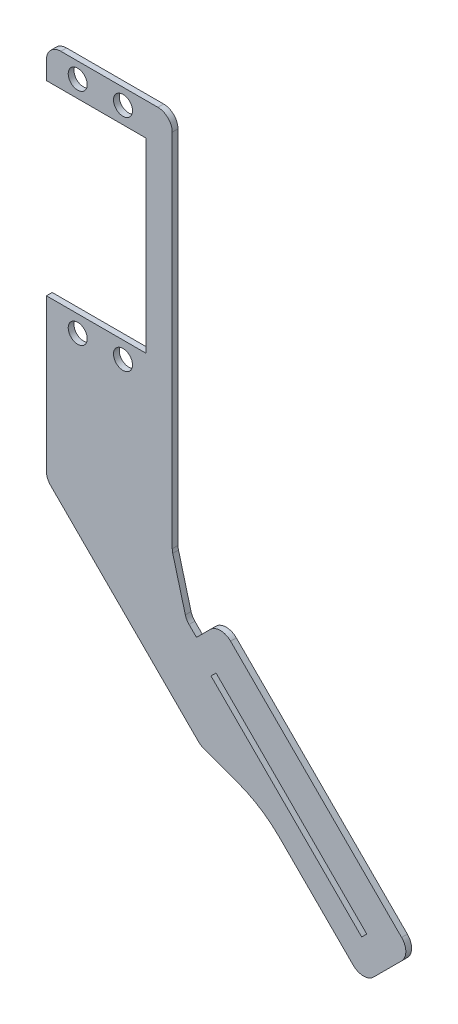
ISO-10303-21;
HEADER;
FILE_DESCRIPTION(('STEP AP214'),'2;1');
FILE_NAME('part.step','',(''),(''),'','','');
FILE_SCHEMA(('AUTOMOTIVE_DESIGN { 1 0 10303 214 1 1 1 1 }'));
ENDSEC;
DATA;
#1=APPLICATION_CONTEXT('core data for automotive mechanical design processes');
#2=APPLICATION_PROTOCOL_DEFINITION('international standard','automotive_design',2000,#1);
#3=PRODUCT_CONTEXT('',#1,'mechanical');
#4=PRODUCT('Part','Part','',(#3));
#5=PRODUCT_RELATED_PRODUCT_CATEGORY('part','',(#4));
#6=PRODUCT_DEFINITION_FORMATION('','',#4);
#7=PRODUCT_DEFINITION_CONTEXT('part definition',#1,'design');
#8=PRODUCT_DEFINITION('design','',#6,#7);
#9=PRODUCT_DEFINITION_SHAPE('','',#8);
#10=(LENGTH_UNIT() NAMED_UNIT(*) SI_UNIT(.MILLI.,.METRE.));
#11=(NAMED_UNIT(*) PLANE_ANGLE_UNIT() SI_UNIT($,.RADIAN.));
#12=(NAMED_UNIT(*) SI_UNIT($,.STERADIAN.) SOLID_ANGLE_UNIT());
#13=UNCERTAINTY_MEASURE_WITH_UNIT(LENGTH_MEASURE(1.E-05),#10,'distance_accuracy_value','');
#14=(GEOMETRIC_REPRESENTATION_CONTEXT(3) GLOBAL_UNCERTAINTY_ASSIGNED_CONTEXT((#13)) GLOBAL_UNIT_ASSIGNED_CONTEXT((#10,
#11,#12)) REPRESENTATION_CONTEXT('',''));
#15=CARTESIAN_POINT('',(0.,0.,0.));
#16=DIRECTION('',(0.,0.,1.));
#17=DIRECTION('',(1.,0.,0.));
#18=AXIS2_PLACEMENT_3D('',#15,#16,#17);
#19=CARTESIAN_POINT('',(-24.4386459429542,-113.02950543493,1.27));
#20=DIRECTION('',(0.707106781186551,0.707106781186544,0.));
#21=DIRECTION('',(-0.707106781186544,0.707106781186551,0.));
#22=AXIS2_PLACEMENT_3D('',#19,#20,#21);
#23=PLANE('',#22);
#24=DIRECTION('',(0.707106781186544,-0.707106781186551,0.));
#25=VECTOR('',#24,1.);
#26=CARTESIAN_POINT('',(-24.4386459429542,-113.02950543493,0.));
#27=LINE('',#26,#25);
#28=CARTESIAN_POINT('',(-43.0102590600247,-94.4578923178591,0.));
#29=VERTEX_POINT('',#28);
#30=CARTESIAN_POINT('',(-26.6837099732214,-110.784441404663,0.));
#31=VERTEX_POINT('',#30);
#32=EDGE_CURVE('E420',#29,#31,#27,.T.);
#33=ORIENTED_EDGE('',*,*,#32,.T.);
#34=DIRECTION('',(0.,0.,-1.));
#35=VECTOR('',#34,1.);
#36=CARTESIAN_POINT('',(-26.6837099732214,-110.784441404663,1.27));
#37=LINE('',#36,#35);
#38=CARTESIAN_POINT('',(-26.6837099732214,-110.784441404663,1.27));
#39=VERTEX_POINT('',#38);
#40=EDGE_CURVE('E595',#31,#39,#37,.F.);
#41=ORIENTED_EDGE('',*,*,#40,.T.);
#42=DIRECTION('',(0.707106781186544,-0.707106781186551,0.));
#43=VECTOR('',#42,1.);
#44=CARTESIAN_POINT('',(-24.4386459429542,-113.02950543493,1.27));
#45=LINE('',#44,#43);
#46=CARTESIAN_POINT('',(-43.0102590600247,-94.4578923178591,1.27));
#47=VERTEX_POINT('',#46);
#48=EDGE_CURVE('E392',#47,#39,#45,.T.);
#49=ORIENTED_EDGE('',*,*,#48,.F.);
#50=DIRECTION('',(0.,0.,1.));
#51=VECTOR('',#50,1.);
#52=CARTESIAN_POINT('',(-43.0102590600247,-94.4578923178591,0.));
#53=LINE('',#52,#51);
#54=EDGE_CURVE('E499',#47,#29,#53,.F.);
#55=ORIENTED_EDGE('',*,*,#54,.T.);
#56=EDGE_LOOP('',(#33,#41,#49,#55));
#57=FACE_BOUND('',#56,.T.);
#58=ADVANCED_FACE('F100',(#57),#23,.F.);
#59=CARTESIAN_POINT('',(0.,0.,0.));
#60=DIRECTION('',(0.,0.,1.));
#61=DIRECTION('',(1.,0.,0.));
#62=AXIS2_PLACEMENT_3D('',#59,#60,#61);
#63=PLANE('',#62);
#64=DIRECTION('',(0.,-1.,0.));
#65=VECTOR('',#64,1.);
#66=CARTESIAN_POINT('',(-94.45625,31.75,0.));
#67=LINE('',#66,#65);
#68=CARTESIAN_POINT('',(-94.45625,28.575,0.));
#69=VERTEX_POINT('',#68);
#70=CARTESIAN_POINT('',(-94.45625,24.549999922,0.));
#71=VERTEX_POINT('',#70);
#72=EDGE_CURVE('E411',#69,#71,#67,.T.);
#73=ORIENTED_EDGE('',*,*,#72,.F.);
#74=CARTESIAN_POINT('',(-91.28125,28.575,0.));
#75=DIRECTION('',(0.,0.,1.));
#76=DIRECTION('',(1.,0.,0.));
#77=AXIS2_PLACEMENT_3D('',#74,#75,#76);
#78=CIRCLE('',#77,3.175);
#79=CARTESIAN_POINT('',(-91.28125,31.75,0.));
#80=VERTEX_POINT('',#79);
#81=EDGE_CURVE('E531',#69,#80,#78,.F.);
#82=ORIENTED_EDGE('',*,*,#81,.T.);
#83=DIRECTION('',(-1.,0.,0.));
#84=VECTOR('',#83,1.);
#85=CARTESIAN_POINT('',(-94.45625,31.75,0.));
#86=LINE('',#85,#84);
#87=CARTESIAN_POINT('',(-69.85,31.75,0.));
#88=VERTEX_POINT('',#87);
#89=EDGE_CURVE('E440',#88,#80,#86,.T.);
#90=ORIENTED_EDGE('',*,*,#89,.F.);
#91=CARTESIAN_POINT('',(-69.85,28.575,0.));
#92=DIRECTION('',(0.,0.,1.));
#93=DIRECTION('',(1.,0.,0.));
#94=AXIS2_PLACEMENT_3D('',#91,#92,#93);
#95=CIRCLE('',#94,3.175);
#96=CARTESIAN_POINT('',(-66.675,28.575,0.));
#97=VERTEX_POINT('',#96);
#98=EDGE_CURVE('E528',#88,#97,#95,.F.);
#99=ORIENTED_EDGE('',*,*,#98,.T.);
#100=DIRECTION('',(0.,1.,0.));
#101=VECTOR('',#100,1.);
#102=CARTESIAN_POINT('',(-66.675,31.75,0.));
#103=LINE('',#102,#101);
#104=CARTESIAN_POINT('',(-66.675,-51.0963760254011,0.));
#105=VERTEX_POINT('',#104);
#106=EDGE_CURVE('E436',#105,#97,#103,.T.);
#107=ORIENTED_EDGE('',*,*,#106,.F.);
#108=CARTESIAN_POINT('',(-63.5,-51.0963760254011,0.));
#109=DIRECTION('',(0.,0.,1.));
#110=DIRECTION('',(1.,0.,0.));
#111=AXIS2_PLACEMENT_3D('',#108,#109,#110);
#112=CIRCLE('',#111,3.175);
#113=CARTESIAN_POINT('',(-66.5668144984679,-51.9181264936013,0.));
#114=VERTEX_POINT('',#113);
#115=EDGE_CURVE('E611',#105,#114,#112,.T.);
#116=ORIENTED_EDGE('',*,*,#115,.T.);
#117=DIRECTION('',(-0.258819045102407,0.965925826289099,0.));
#118=VECTOR('',#117,1.);
#119=CARTESIAN_POINT('',(-66.675,-51.514372705241,0.));
#120=LINE('',#119,#118);
#121=CARTESIAN_POINT('',(-63.7830668735738,-62.30721406516,0.));
#122=VERTEX_POINT('',#121);
#123=EDGE_CURVE('E432',#122,#114,#120,.T.);
#124=ORIENTED_EDGE('',*,*,#123,.F.);
#125=CARTESIAN_POINT('',(-60.7162523751059,-61.4854635969599,0.));
#126=DIRECTION('',(0.,0.,1.));
#127=DIRECTION('',(1.,0.,0.));
#128=AXIS2_PLACEMENT_3D('',#125,#126,#127);
#129=CIRCLE('',#128,3.175);
#130=CARTESIAN_POINT('',(-62.9613164053732,-63.7305276272271,0.));
#131=VERTEX_POINT('',#130);
#132=EDGE_CURVE('E109',#122,#131,#129,.T.);
#133=ORIENTED_EDGE('',*,*,#132,.T.);
#134=DIRECTION('',(-0.707106781186544,0.707106781186551,0.));
#135=VECTOR('',#134,1.);
#136=CARTESIAN_POINT('',(-19.0504922703126,-107.641351762288,0.));
#137=LINE('',#136,#135);
#138=CARTESIAN_POINT('',(-61.3178154689724,-65.374028563628,0.));
#139=VERTEX_POINT('',#138);
#140=EDGE_CURVE('E424',#139,#131,#137,.T.);
#141=ORIENTED_EDGE('',*,*,#140,.F.);
#142=DIRECTION('',(0.707106781186544,0.707106781186551,0.));
#143=VECTOR('',#142,1.);
#144=CARTESIAN_POINT('',(-62.7731733770223,-66.8293864716779,0.));
#145=LINE('',#144,#143);
#146=CARTESIAN_POINT('',(-58.2830453164879,-62.3392584111435,0.));
#147=VERTEX_POINT('',#146);
#148=EDGE_CURVE('E481',#139,#147,#145,.T.);
#149=ORIENTED_EDGE('',*,*,#148,.T.);
#150=CARTESIAN_POINT('',(-56.0379812862206,-64.5843224414107,0.));
#151=DIRECTION('',(0.,0.,1.));
#152=DIRECTION('',(1.,0.,0.));
#153=AXIS2_PLACEMENT_3D('',#150,#151,#152);
#154=CIRCLE('',#153,3.175);
#155=CARTESIAN_POINT('',(-53.7929172559533,-62.3392584111434,0.));
#156=VERTEX_POINT('',#155);
#157=EDGE_CURVE('E525',#147,#156,#154,.F.);
#158=ORIENTED_EDGE('',*,*,#157,.T.);
#159=DIRECTION('',(0.707106781186551,-0.707106781186544,0.));
#160=VECTOR('',#159,1.);
#161=CARTESIAN_POINT('',(-58.0660878335488,-58.066087833548,0.));
#162=LINE('',#161,#160);
#163=CARTESIAN_POINT('',(-16.0157221178277,-100.116453549269,0.));
#164=VERTEX_POINT('',#163);
#165=EDGE_CURVE('E477',#156,#164,#162,.T.);
#166=ORIENTED_EDGE('',*,*,#165,.T.);
#167=CARTESIAN_POINT('',(-18.260786148095,-102.361517579536,0.));
#168=DIRECTION('',(0.,0.,1.));
#169=DIRECTION('',(1.,0.,0.));
#170=AXIS2_PLACEMENT_3D('',#167,#168,#169);
#171=CIRCLE('',#170,3.175);
#172=CARTESIAN_POINT('',(-16.0157221178277,-104.606581609803,0.));
#173=VERTEX_POINT('',#172);
#174=EDGE_CURVE('E522',#164,#173,#171,.F.);
#175=ORIENTED_EDGE('',*,*,#174,.T.);
#176=DIRECTION('',(-0.707106781186544,-0.707106781186551,0.));
#177=VECTOR('',#176,1.);
#178=CARTESIAN_POINT('',(-20.505850178362,-109.096709670338,0.));
#179=LINE('',#178,#177);
#180=CARTESIAN_POINT('',(-22.1935819126868,-110.784441404663,0.));
#181=VERTEX_POINT('',#180);
#182=EDGE_CURVE('E472',#173,#181,#179,.T.);
#183=ORIENTED_EDGE('',*,*,#182,.T.);
#184=CARTESIAN_POINT('',(-24.4386459429541,-108.539377374395,0.));
#185=DIRECTION('',(0.,0.,1.));
#186=DIRECTION('',(1.,0.,0.));
#187=AXIS2_PLACEMENT_3D('',#184,#185,#186);
#188=CIRCLE('',#187,3.175);
#189=EDGE_CURVE('E519',#181,#31,#188,.F.);
#190=ORIENTED_EDGE('',*,*,#189,.T.);
#191=ORIENTED_EDGE('',*,*,#32,.F.);
#192=CARTESIAN_POINT('',(-60.9707713021631,-112.418404559997,0.));
#193=DIRECTION('',(0.,0.,1.));
#194=DIRECTION('',(1.,0.,0.));
#195=AXIS2_PLACEMENT_3D('',#192,#193,#194);
#196=CIRCLE('',#195,25.4);
#197=CARTESIAN_POINT('',(-52.283459661691,-88.5502119920353,0.));
#198=VERTEX_POINT('',#197);
#199=EDGE_CURVE('E505',#29,#198,#196,.T.);
#200=ORIENTED_EDGE('',*,*,#199,.T.);
#201=DIRECTION('',(0.939692620785907,-0.342020143325674,0.));
#202=VECTOR('',#201,1.);
#203=CARTESIAN_POINT('',(-34.5754925122076,-94.9953849438111,0.));
#204=LINE('',#203,#202);
#205=CARTESIAN_POINT('',(-59.6986173651886,-85.8513153055724,0.));
#206=VERTEX_POINT('',#205);
#207=EDGE_CURVE('E688',#206,#198,#204,.T.);
#208=ORIENTED_EDGE('',*,*,#207,.F.);
#209=CARTESIAN_POINT('',(-58.6127034101296,-82.8677912345771,0.));
#210=DIRECTION('',(0.,0.,1.));
#211=DIRECTION('',(1.,0.,0.));
#212=AXIS2_PLACEMENT_3D('',#209,#210,#211);
#213=CIRCLE('',#212,3.175);
#214=CARTESIAN_POINT('',(-60.8577674403969,-85.1128552648444,0.));
#215=VERTEX_POINT('',#214);
#216=EDGE_CURVE('E516',#206,#215,#213,.F.);
#217=ORIENTED_EDGE('',*,*,#216,.T.);
#218=DIRECTION('',(0.707106781186544,-0.707106781186551,0.));
#219=VECTOR('',#218,1.);
#220=CARTESIAN_POINT('',(-80.5656250000001,-65.404997705241,0.));
#221=LINE('',#220,#219);
#222=CARTESIAN_POINT('',(-93.5263140302673,-52.4443086749737,0.));
#223=VERTEX_POINT('',#222);
#224=EDGE_CURVE('E416',#223,#215,#221,.T.);
#225=ORIENTED_EDGE('',*,*,#224,.F.);
#226=CARTESIAN_POINT('',(-91.28125,-50.1992446447064,0.));
#227=DIRECTION('',(0.,0.,1.));
#228=DIRECTION('',(1.,0.,0.));
#229=AXIS2_PLACEMENT_3D('',#226,#227,#228);
#230=CIRCLE('',#229,3.175);
#231=CARTESIAN_POINT('',(-94.45625,-50.1992446447064,0.));
#232=VERTEX_POINT('',#231);
#233=EDGE_CURVE('E513',#223,#232,#230,.F.);
#234=ORIENTED_EDGE('',*,*,#233,.T.);
#235=CARTESIAN_POINT('',(-94.45625,-16.604000066,0.));
#236=VERTEX_POINT('',#235);
#237=EDGE_CURVE('E410',#236,#232,#67,.T.);
#238=ORIENTED_EDGE('',*,*,#237,.F.);
#239=DIRECTION('',(1.,0.,0.));
#240=VECTOR('',#239,1.);
#241=CARTESIAN_POINT('',(-92.6769999390001,-16.604000066,0.));
#242=LINE('',#241,#240);
#243=CARTESIAN_POINT('',(-72.423000061,-16.604000066,0.));
#244=VERTEX_POINT('',#243);
#245=EDGE_CURVE('E356',#236,#244,#242,.T.);
#246=ORIENTED_EDGE('',*,*,#245,.T.);
#247=DIRECTION('',(0.,1.,0.));
#248=VECTOR('',#247,1.);
#249=CARTESIAN_POINT('',(-72.423000061,-16.604000066,0.));
#250=LINE('',#249,#248);
#251=CARTESIAN_POINT('',(-72.423000061,24.549999922,0.));
#252=VERTEX_POINT('',#251);
#253=EDGE_CURVE('E352',#244,#252,#250,.T.);
#254=ORIENTED_EDGE('',*,*,#253,.T.);
#255=DIRECTION('',(-1.,0.,0.));
#256=VECTOR('',#255,1.);
#257=CARTESIAN_POINT('',(-83.05,24.549999922,0.));
#258=LINE('',#257,#256);
#259=EDGE_CURVE('E348',#252,#71,#258,.T.);
#260=ORIENTED_EDGE('',*,*,#259,.T.);
#261=EDGE_LOOP('',(#73,#82,#90,#99,#107,#116,#124,#133,#141,#149,#158,#166,#175,#183,#190,#191,
#200,#208,#217,#225,#234,#238,#246,#254,#260));
#262=FACE_BOUND('',#261,.T.);
#263=CARTESIAN_POINT('',(-87.550000033,28.272999969,0.));
#264=DIRECTION('',(0.,0.,1.));
#265=DIRECTION('',(1.,0.,0.));
#266=AXIS2_PLACEMENT_3D('',#263,#264,#265);
#267=CIRCLE('',#266,2.09999999099995);
#268=CARTESIAN_POINT('',(-85.4500000420001,28.272999969,0.));
#269=VERTEX_POINT('',#268);
#270=EDGE_CURVE('E343',#269,#269,#267,.T.);
#271=ORIENTED_EDGE('',*,*,#270,.T.);
#272=EDGE_LOOP('',(#271));
#273=FACE_BOUND('',#272,.T.);
#274=CARTESIAN_POINT('',(-77.549999967,28.272999969,0.));
#275=DIRECTION('',(0.,0.,1.));
#276=DIRECTION('',(1.,0.,0.));
#277=AXIS2_PLACEMENT_3D('',#274,#275,#276);
#278=CIRCLE('',#277,2.09999999100001);
#279=CARTESIAN_POINT('',(-75.449999976,28.272999969,0.));
#280=VERTEX_POINT('',#279);
#281=EDGE_CURVE('E360',#280,#280,#278,.T.);
#282=ORIENTED_EDGE('',*,*,#281,.T.);
#283=EDGE_LOOP('',(#282));
#284=FACE_BOUND('',#283,.T.);
#285=CARTESIAN_POINT('',(-87.550000033,-20.327000113,0.));
#286=DIRECTION('',(0.,0.,1.));
#287=DIRECTION('',(1.,0.,0.));
#288=AXIS2_PLACEMENT_3D('',#285,#286,#287);
#289=CIRCLE('',#288,2.09999999099995);
#290=CARTESIAN_POINT('',(-85.4500000420001,-20.327000113,0.));
#291=VERTEX_POINT('',#290);
#292=EDGE_CURVE('E364',#291,#291,#289,.T.);
#293=ORIENTED_EDGE('',*,*,#292,.T.);
#294=EDGE_LOOP('',(#293));
#295=FACE_BOUND('',#294,.T.);
#296=CARTESIAN_POINT('',(-77.549999967,-20.327000113,0.));
#297=DIRECTION('',(0.,0.,1.));
#298=DIRECTION('',(1.,0.,0.));
#299=AXIS2_PLACEMENT_3D('',#296,#297,#298);
#300=CIRCLE('',#299,2.09999999100001);
#301=CARTESIAN_POINT('',(-75.449999976,-20.327000113,0.));
#302=VERTEX_POINT('',#301);
#303=EDGE_CURVE('E368',#302,#302,#300,.T.);
#304=ORIENTED_EDGE('',*,*,#303,.T.);
#305=EDGE_LOOP('',(#304));
#306=FACE_BOUND('',#305,.T.);
#307=DIRECTION('',(-0.707106781186543,-0.707106781186552,0.));
#308=VECTOR('',#307,1.);
#309=CARTESIAN_POINT('',(-23.707033277305,-103.317636648211,0.));
#310=LINE('',#309,#308);
#311=CARTESIAN_POINT('',(-23.707033277305,-103.317636648211,0.));
#312=VERTEX_POINT('',#311);
#313=CARTESIAN_POINT('',(-24.8295652924386,-104.440168663345,0.));
#314=VERTEX_POINT('',#313);
#315=EDGE_CURVE('E318',#312,#314,#310,.T.);
#316=ORIENTED_EDGE('',*,*,#315,.F.);
#317=DIRECTION('',(0.707106781186547,-0.707106781186548,0.));
#318=VECTOR('',#317,1.);
#319=CARTESIAN_POINT('',(-42.5956308463677,-84.4290390791487,0.));
#320=LINE('',#319,#318);
#321=CARTESIAN_POINT('',(-56.9941003548958,-70.0305695706206,0.));
#322=VERTEX_POINT('',#321);
#323=EDGE_CURVE('E309',#322,#312,#320,.T.);
#324=ORIENTED_EDGE('',*,*,#323,.F.);
#325=DIRECTION('',(0.707106781186543,0.707106781186552,0.));
#326=VECTOR('',#325,1.);
#327=CARTESIAN_POINT('',(-58.1166323700295,-71.1531015857542,0.));
#328=LINE('',#327,#326);
#329=CARTESIAN_POINT('',(-58.1166323700295,-71.1531015857542,0.));
#330=VERTEX_POINT('',#329);
#331=EDGE_CURVE('E293',#330,#322,#328,.T.);
#332=ORIENTED_EDGE('',*,*,#331,.F.);
#333=DIRECTION('',(0.707106781186547,-0.707106781186548,0.));
#334=VECTOR('',#333,1.);
#335=CARTESIAN_POINT('',(-43.7181628615013,-85.5515710942823,0.));
#336=LINE('',#335,#334);
#337=EDGE_CURVE('E327',#330,#314,#336,.T.);
#338=ORIENTED_EDGE('',*,*,#337,.T.);
#339=EDGE_LOOP('',(#316,#324,#332,#338));
#340=FACE_BOUND('',#339,.T.);
#341=ADVANCED_FACE('F317',(#262,#273,#284,#295,#306,#340),#63,.F.);
#342=CARTESIAN_POINT('',(-64.8012799243505,-64.8012799243498,1.26999999999999));
#343=DIRECTION('',(0.,0.,1.));
#344=DIRECTION('',(0.707106781186551,-0.707106781186544,0.));
#345=AXIS2_PLACEMENT_3D('',#342,#343,#344);
#346=PLANE('',#345);
#347=DIRECTION('',(-1.,0.,0.));
#348=VECTOR('',#347,1.);
#349=CARTESIAN_POINT('',(-94.45625,31.75,1.27));
#350=LINE('',#349,#348);
#351=CARTESIAN_POINT('',(-69.85,31.75,1.27));
#352=VERTEX_POINT('',#351);
#353=CARTESIAN_POINT('',(-91.28125,31.75,1.27));
#354=VERTEX_POINT('',#353);
#355=EDGE_CURVE('E375',#352,#354,#350,.T.);
#356=ORIENTED_EDGE('',*,*,#355,.T.);
#357=CARTESIAN_POINT('',(-91.28125,28.575,1.26999999999969));
#358=DIRECTION('',(0.,0.,1.));
#359=DIRECTION('',(0.,-1.,0.));
#360=AXIS2_PLACEMENT_3D('',#357,#358,#359);
#361=CIRCLE('',#360,3.175);
#362=CARTESIAN_POINT('',(-94.45625,28.575,1.27));
#363=VERTEX_POINT('',#362);
#364=EDGE_CURVE('E557',#354,#363,#361,.T.);
#365=ORIENTED_EDGE('',*,*,#364,.T.);
#366=DIRECTION('',(0.,-1.,0.));
#367=VECTOR('',#366,1.);
#368=CARTESIAN_POINT('',(-94.45625,31.75,1.27));
#369=LINE('',#368,#367);
#370=CARTESIAN_POINT('',(-94.45625,24.549999922,1.27));
#371=VERTEX_POINT('',#370);
#372=EDGE_CURVE('E372',#363,#371,#369,.T.);
#373=ORIENTED_EDGE('',*,*,#372,.T.);
#374=DIRECTION('',(-1.,0.,0.));
#375=VECTOR('',#374,1.);
#376=CARTESIAN_POINT('',(-72.423000061,24.549999922,1.27));
#377=LINE('',#376,#375);
#378=CARTESIAN_POINT('',(-72.423000061,24.549999922,1.27));
#379=VERTEX_POINT('',#378);
#380=EDGE_CURVE('E415',#379,#371,#377,.T.);
#381=ORIENTED_EDGE('',*,*,#380,.F.);
#382=DIRECTION('',(0.,1.,0.));
#383=VECTOR('',#382,1.);
#384=CARTESIAN_POINT('',(-72.423000061,-16.604000066,1.27));
#385=LINE('',#384,#383);
#386=CARTESIAN_POINT('',(-72.423000061,-16.604000066,1.27));
#387=VERTEX_POINT('',#386);
#388=EDGE_CURVE('E454',#387,#379,#385,.T.);
#389=ORIENTED_EDGE('',*,*,#388,.F.);
#390=DIRECTION('',(1.,0.,0.));
#391=VECTOR('',#390,1.);
#392=CARTESIAN_POINT('',(-82.05,-16.604000066,1.27));
#393=LINE('',#392,#391);
#394=CARTESIAN_POINT('',(-94.45625,-16.604000066,1.27));
#395=VERTEX_POINT('',#394);
#396=EDGE_CURVE('E403',#395,#387,#393,.T.);
#397=ORIENTED_EDGE('',*,*,#396,.F.);
#398=CARTESIAN_POINT('',(-94.45625,-50.1992446447064,1.27));
#399=VERTEX_POINT('',#398);
#400=EDGE_CURVE('E376',#395,#399,#369,.T.);
#401=ORIENTED_EDGE('',*,*,#400,.T.);
#402=CARTESIAN_POINT('',(-91.28125,-50.1992446447064,1.27000000000003));
#403=DIRECTION('',(0.,0.,1.));
#404=DIRECTION('',(0.,-1.,0.));
#405=AXIS2_PLACEMENT_3D('',#402,#403,#404);
#406=CIRCLE('',#405,3.175);
#407=CARTESIAN_POINT('',(-93.5263140302673,-52.4443086749737,1.27));
#408=VERTEX_POINT('',#407);
#409=EDGE_CURVE('E124',#399,#408,#406,.T.);
#410=ORIENTED_EDGE('',*,*,#409,.T.);
#411=DIRECTION('',(0.707106781186544,-0.707106781186551,0.));
#412=VECTOR('',#411,1.);
#413=CARTESIAN_POINT('',(-80.5656250000001,-65.404997705241,1.27));
#414=LINE('',#413,#412);
#415=CARTESIAN_POINT('',(-60.8577674403969,-85.1128552648444,1.27));
#416=VERTEX_POINT('',#415);
#417=EDGE_CURVE('E396',#408,#416,#414,.T.);
#418=ORIENTED_EDGE('',*,*,#417,.T.);
#419=CARTESIAN_POINT('',(-58.6127034101296,-82.8677912345771,1.27000000000005));
#420=DIRECTION('',(0.,0.,1.));
#421=DIRECTION('',(0.,-1.,0.));
#422=AXIS2_PLACEMENT_3D('',#419,#420,#421);
#423=CIRCLE('',#422,3.175);
#424=CARTESIAN_POINT('',(-59.6986173651886,-85.8513153055724,1.26999999999945));
#425=VERTEX_POINT('',#424);
#426=EDGE_CURVE('E116',#416,#425,#423,.T.);
#427=ORIENTED_EDGE('',*,*,#426,.T.);
#428=DIRECTION('',(-0.939692620785907,0.342020143325674,0.));
#429=VECTOR('',#428,1.);
#430=CARTESIAN_POINT('',(-34.5754925122076,-94.9953849438111,1.26999999999945));
#431=LINE('',#430,#429);
#432=CARTESIAN_POINT('',(-52.283459661691,-88.5502119920353,1.26999999999945));
#433=VERTEX_POINT('',#432);
#434=EDGE_CURVE('E692',#433,#425,#431,.T.);
#435=ORIENTED_EDGE('',*,*,#434,.F.);
#436=CARTESIAN_POINT('',(-60.9707713021631,-112.418404559997,1.27000000000019));
#437=DIRECTION('',(0.,0.,1.));
#438=DIRECTION('',(0.,-1.,0.));
#439=AXIS2_PLACEMENT_3D('',#436,#437,#438);
#440=CIRCLE('',#439,25.4);
#441=EDGE_CURVE('E502',#433,#47,#440,.F.);
#442=ORIENTED_EDGE('',*,*,#441,.T.);
#443=ORIENTED_EDGE('',*,*,#48,.T.);
#444=CARTESIAN_POINT('',(-24.4386459429541,-108.539377374395,1.27000000000003));
#445=DIRECTION('',(0.,0.,1.));
#446=DIRECTION('',(0.,-1.,0.));
#447=AXIS2_PLACEMENT_3D('',#444,#445,#446);
#448=CIRCLE('',#447,3.175);
#449=CARTESIAN_POINT('',(-22.1935819126868,-110.784441404663,1.27000000000003));
#450=VERTEX_POINT('',#449);
#451=EDGE_CURVE('E545',#39,#450,#448,.T.);
#452=ORIENTED_EDGE('',*,*,#451,.T.);
#453=DIRECTION('',(0.707106781186544,0.707106781186551,0.));
#454=VECTOR('',#453,1.);
#455=CARTESIAN_POINT('',(-19.6078245662553,-108.198684058231,1.27000000000001));
#456=LINE('',#455,#454);
#457=CARTESIAN_POINT('',(-16.0157221178277,-104.606581609803,1.26999999999998));
#458=VERTEX_POINT('',#457);
#459=EDGE_CURVE('E485',#458,#450,#456,.F.);
#460=ORIENTED_EDGE('',*,*,#459,.F.);
#461=CARTESIAN_POINT('',(-18.260786148095,-102.361517579536,1.26999999999997));
#462=DIRECTION('',(0.,0.,1.));
#463=DIRECTION('',(0.,-1.,0.));
#464=AXIS2_PLACEMENT_3D('',#461,#462,#463);
#465=CIRCLE('',#464,3.175);
#466=CARTESIAN_POINT('',(-16.0157221178277,-100.116453549269,1.26999999999996));
#467=VERTEX_POINT('',#466);
#468=EDGE_CURVE('E548',#458,#467,#465,.T.);
#469=ORIENTED_EDGE('',*,*,#468,.T.);
#470=DIRECTION('',(-0.707106781186551,0.707106781186544,0.));
#471=VECTOR('',#470,1.);
#472=CARTESIAN_POINT('',(-13.7706580875604,-102.361517579536,1.26999999999997));
#473=LINE('',#472,#471);
#474=CARTESIAN_POINT('',(-53.7929172559533,-62.3392584111434,1.26999999999995));
#475=VERTEX_POINT('',#474);
#476=EDGE_CURVE('E489',#475,#467,#473,.F.);
#477=ORIENTED_EDGE('',*,*,#476,.F.);
#478=CARTESIAN_POINT('',(-56.0379812862206,-64.5843224414107,1.26999999999996));
#479=DIRECTION('',(0.,0.,1.));
#480=DIRECTION('',(0.,-1.,0.));
#481=AXIS2_PLACEMENT_3D('',#478,#479,#480);
#482=CIRCLE('',#481,3.175);
#483=CARTESIAN_POINT('',(-58.2830453164879,-62.3392584111435,1.26999999999998));
#484=VERTEX_POINT('',#483);
#485=EDGE_CURVE('E551',#475,#484,#482,.T.);
#486=ORIENTED_EDGE('',*,*,#485,.T.);
#487=DIRECTION('',(-0.707106781186544,-0.707106781186551,0.));
#488=VECTOR('',#487,1.);
#489=CARTESIAN_POINT('',(-56.0379812862206,-60.0941943808762,1.26999999999997));
#490=LINE('',#489,#488);
#491=CARTESIAN_POINT('',(-61.3178154689724,-65.374028563628,1.27000000000001));
#492=VERTEX_POINT('',#491);
#493=EDGE_CURVE('E347',#492,#484,#490,.F.);
#494=ORIENTED_EDGE('',*,*,#493,.F.);
#495=DIRECTION('',(-0.707106781186544,0.707106781186551,0.));
#496=VECTOR('',#495,1.);
#497=CARTESIAN_POINT('',(-19.0504922703126,-107.641351762288,1.27));
#498=LINE('',#497,#496);
#499=CARTESIAN_POINT('',(-62.9613164053732,-63.7305276272271,1.27));
#500=VERTEX_POINT('',#499);
#501=EDGE_CURVE('E388',#492,#500,#498,.T.);
#502=ORIENTED_EDGE('',*,*,#501,.T.);
#503=CARTESIAN_POINT('',(-60.7162523751059,-61.4854635969599,1.26999999999996));
#504=DIRECTION('',(0.,0.,1.));
#505=DIRECTION('',(0.,-1.,0.));
#506=AXIS2_PLACEMENT_3D('',#503,#504,#505);
#507=CIRCLE('',#506,3.175);
#508=CARTESIAN_POINT('',(-63.7830668735738,-62.30721406516,1.27));
#509=VERTEX_POINT('',#508);
#510=EDGE_CURVE('E13',#500,#509,#507,.F.);
#511=ORIENTED_EDGE('',*,*,#510,.T.);
#512=DIRECTION('',(-0.258819045102407,0.965925826289099,0.));
#513=VECTOR('',#512,1.);
#514=CARTESIAN_POINT('',(-66.675,-51.514372705241,1.27));
#515=LINE('',#514,#513);
#516=CARTESIAN_POINT('',(-66.5668144984679,-51.9181264936013,1.27));
#517=VERTEX_POINT('',#516);
#518=EDGE_CURVE('E384',#509,#517,#515,.T.);
#519=ORIENTED_EDGE('',*,*,#518,.T.);
#520=CARTESIAN_POINT('',(-63.5,-51.0963760254011,1.26999999999993));
#521=DIRECTION('',(0.,0.,1.));
#522=DIRECTION('',(0.,-1.,0.));
#523=AXIS2_PLACEMENT_3D('',#520,#521,#522);
#524=CIRCLE('',#523,3.175);
#525=CARTESIAN_POINT('',(-66.675,-51.0963760254011,1.27));
#526=VERTEX_POINT('',#525);
#527=EDGE_CURVE('E614',#517,#526,#524,.F.);
#528=ORIENTED_EDGE('',*,*,#527,.T.);
#529=DIRECTION('',(0.,1.,0.));
#530=VECTOR('',#529,1.);
#531=CARTESIAN_POINT('',(-66.675,31.75,1.27));
#532=LINE('',#531,#530);
#533=CARTESIAN_POINT('',(-66.675,28.575,1.27));
#534=VERTEX_POINT('',#533);
#535=EDGE_CURVE('E380',#526,#534,#532,.T.);
#536=ORIENTED_EDGE('',*,*,#535,.T.);
#537=CARTESIAN_POINT('',(-69.85,28.575,1.2699999999996));
#538=DIRECTION('',(0.,0.,1.));
#539=DIRECTION('',(0.,-1.,0.));
#540=AXIS2_PLACEMENT_3D('',#537,#538,#539);
#541=CIRCLE('',#540,3.175);
#542=EDGE_CURVE('E554',#534,#352,#541,.T.);
#543=ORIENTED_EDGE('',*,*,#542,.T.);
#544=EDGE_LOOP('',(#356,#365,#373,#381,#389,#397,#401,#410,#418,#427,#435,#442,#443,#452,#460,
#469,#477,#486,#494,#502,#511,#519,#528,#536,#543));
#545=FACE_BOUND('',#544,.T.);
#546=CARTESIAN_POINT('',(-87.550000033,-20.327000113,1.27));
#547=DIRECTION('',(0.,0.,1.));
#548=DIRECTION('',(1.,0.,0.));
#549=AXIS2_PLACEMENT_3D('',#546,#547,#548);
#550=CIRCLE('',#549,2.09999999099995);
#551=CARTESIAN_POINT('',(-85.4500000420001,-20.327000113,1.27));
#552=VERTEX_POINT('',#551);
#553=EDGE_CURVE('E457',#552,#552,#550,.T.);
#554=ORIENTED_EDGE('',*,*,#553,.F.);
#555=EDGE_LOOP('',(#554));
#556=FACE_BOUND('',#555,.T.);
#557=CARTESIAN_POINT('',(-87.550000033,28.272999969,1.27));
#558=DIRECTION('',(0.,0.,1.));
#559=DIRECTION('',(1.,0.,0.));
#560=AXIS2_PLACEMENT_3D('',#557,#558,#559);
#561=CIRCLE('',#560,2.09999999099995);
#562=CARTESIAN_POINT('',(-85.4500000420001,28.272999969,1.27));
#563=VERTEX_POINT('',#562);
#564=EDGE_CURVE('E461',#563,#563,#561,.T.);
#565=ORIENTED_EDGE('',*,*,#564,.F.);
#566=EDGE_LOOP('',(#565));
#567=FACE_BOUND('',#566,.T.);
#568=CARTESIAN_POINT('',(-77.549999967,28.272999969,1.27));
#569=DIRECTION('',(0.,0.,1.));
#570=DIRECTION('',(1.,0.,0.));
#571=AXIS2_PLACEMENT_3D('',#568,#569,#570);
#572=CIRCLE('',#571,2.09999999100001);
#573=CARTESIAN_POINT('',(-75.449999976,28.272999969,1.27));
#574=VERTEX_POINT('',#573);
#575=EDGE_CURVE('E465',#574,#574,#572,.T.);
#576=ORIENTED_EDGE('',*,*,#575,.F.);
#577=EDGE_LOOP('',(#576));
#578=FACE_BOUND('',#577,.T.);
#579=CARTESIAN_POINT('',(-77.549999967,-20.327000113,1.27));
#580=DIRECTION('',(0.,0.,1.));
#581=DIRECTION('',(1.,0.,0.));
#582=AXIS2_PLACEMENT_3D('',#579,#580,#581);
#583=CIRCLE('',#582,2.09999999100001);
#584=CARTESIAN_POINT('',(-75.449999976,-20.327000113,1.27));
#585=VERTEX_POINT('',#584);
#586=EDGE_CURVE('E341',#585,#585,#583,.T.);
#587=ORIENTED_EDGE('',*,*,#586,.F.);
#588=EDGE_LOOP('',(#587));
#589=FACE_BOUND('',#588,.T.);
#590=DIRECTION('',(0.707106781186547,-0.707106781186548,0.));
#591=VECTOR('',#590,1.);
#592=CARTESIAN_POINT('',(-42.5956308463677,-84.4290390791487,1.26999999999945));
#593=LINE('',#592,#591);
#594=CARTESIAN_POINT('',(-56.9941003548958,-70.0305695706206,1.26999999999999));
#595=VERTEX_POINT('',#594);
#596=CARTESIAN_POINT('',(-23.707033277305,-103.317636648211,1.26999999999945));
#597=VERTEX_POINT('',#596);
#598=EDGE_CURVE('E312',#595,#597,#593,.T.);
#599=ORIENTED_EDGE('',*,*,#598,.T.);
#600=DIRECTION('',(-0.707106781186543,-0.707106781186552,0.));
#601=VECTOR('',#600,1.);
#602=CARTESIAN_POINT('',(-23.707033277305,-103.317636648211,1.26999999999945));
#603=LINE('',#602,#601);
#604=CARTESIAN_POINT('',(-24.8295652924386,-104.440168663345,1.26999999999945));
#605=VERTEX_POINT('',#604);
#606=EDGE_CURVE('E334',#597,#605,#603,.T.);
#607=ORIENTED_EDGE('',*,*,#606,.T.);
#608=DIRECTION('',(0.707106781186547,-0.707106781186548,0.));
#609=VECTOR('',#608,1.);
#610=CARTESIAN_POINT('',(-43.7181628615013,-85.5515710942823,1.26999999999945));
#611=LINE('',#610,#609);
#612=CARTESIAN_POINT('',(-58.1166323700295,-71.1531015857542,1.26999999999945));
#613=VERTEX_POINT('',#612);
#614=EDGE_CURVE('E331',#613,#605,#611,.T.);
#615=ORIENTED_EDGE('',*,*,#614,.F.);
#616=DIRECTION('',(0.707106781186543,0.707106781186552,0.));
#617=VECTOR('',#616,1.);
#618=CARTESIAN_POINT('',(-58.1166323700295,-71.1531015857542,1.26999999999945));
#619=LINE('',#618,#617);
#620=EDGE_CURVE('E305',#613,#595,#619,.T.);
#621=ORIENTED_EDGE('',*,*,#620,.T.);
#622=EDGE_LOOP('',(#599,#607,#615,#621));
#623=FACE_BOUND('',#622,.T.);
#624=ADVANCED_FACE('F631',(#545,#556,#567,#578,#589,#623),#346,.T.);
#625=CARTESIAN_POINT('',(-56.0379812862206,-60.0941943808762,0.));
#626=DIRECTION('',(0.707106781186551,-0.707106781186544,0.));
#627=DIRECTION('',(0.,0.,-1.));
#628=AXIS2_PLACEMENT_3D('',#625,#626,#627);
#629=PLANE('',#628);
#630=ORIENTED_EDGE('',*,*,#493,.T.);
#631=DIRECTION('',(0.,0.,1.));
#632=VECTOR('',#631,1.);
#633=CARTESIAN_POINT('',(-58.2830453164879,-62.3392584111435,0.));
#634=LINE('',#633,#632);
#635=EDGE_CURVE('E584',#484,#147,#634,.F.);
#636=ORIENTED_EDGE('',*,*,#635,.T.);
#637=ORIENTED_EDGE('',*,*,#148,.F.);
#638=DIRECTION('',(0.,0.,-1.));
#639=VECTOR('',#638,1.);
#640=CARTESIAN_POINT('',(-61.3178154689724,-65.374028563628,1.27));
#641=LINE('',#640,#639);
#642=EDGE_CURVE('E428',#492,#139,#641,.T.);
#643=ORIENTED_EDGE('',*,*,#642,.F.);
#644=EDGE_LOOP('',(#630,#636,#637,#643));
#645=FACE_BOUND('',#644,.T.);
#646=ADVANCED_FACE('F714',(#645),#629,.F.);
#647=CARTESIAN_POINT('',(-19.6078245662553,-108.198684058231,0.));
#648=DIRECTION('',(-0.707106781186551,0.707106781186544,0.));
#649=DIRECTION('',(0.,0.,1.));
#650=AXIS2_PLACEMENT_3D('',#647,#648,#649);
#651=PLANE('',#650);
#652=ORIENTED_EDGE('',*,*,#182,.F.);
#653=DIRECTION('',(0.,0.,1.));
#654=VECTOR('',#653,1.);
#655=CARTESIAN_POINT('',(-16.0157221178277,-104.606581609803,0.));
#656=LINE('',#655,#654);
#657=EDGE_CURVE('E591',#173,#458,#656,.T.);
#658=ORIENTED_EDGE('',*,*,#657,.T.);
#659=ORIENTED_EDGE('',*,*,#459,.T.);
#660=DIRECTION('',(0.,0.,-1.));
#661=VECTOR('',#660,1.);
#662=CARTESIAN_POINT('',(-22.1935819126868,-110.784441404663,0.));
#663=LINE('',#662,#661);
#664=EDGE_CURVE('E587',#450,#181,#663,.T.);
#665=ORIENTED_EDGE('',*,*,#664,.T.);
#666=EDGE_LOOP('',(#652,#658,#659,#665));
#667=FACE_BOUND('',#666,.T.);
#668=ADVANCED_FACE('F720',(#667),#651,.F.);
#669=CARTESIAN_POINT('',(-13.7706580875604,-102.361517579536,0.));
#670=DIRECTION('',(-0.707106781186544,-0.707106781186551,0.));
#671=DIRECTION('',(-0.499999999999997,0.499999999999999,0.707106781186551));
#672=AXIS2_PLACEMENT_3D('',#669,#670,#671);
#673=PLANE('',#672);
#674=ORIENTED_EDGE('',*,*,#165,.F.);
#675=DIRECTION('',(0.,0.,1.));
#676=VECTOR('',#675,1.);
#677=CARTESIAN_POINT('',(-53.7929172559533,-62.3392584111434,0.));
#678=LINE('',#677,#676);
#679=EDGE_CURVE('E580',#156,#475,#678,.T.);
#680=ORIENTED_EDGE('',*,*,#679,.T.);
#681=ORIENTED_EDGE('',*,*,#476,.T.);
#682=DIRECTION('',(0.,0.,1.));
#683=VECTOR('',#682,1.);
#684=CARTESIAN_POINT('',(-16.0157221178277,-100.116453549269,0.));
#685=LINE('',#684,#683);
#686=EDGE_CURVE('E577',#467,#164,#685,.F.);
#687=ORIENTED_EDGE('',*,*,#686,.T.);
#688=EDGE_LOOP('',(#674,#680,#681,#687));
#689=FACE_BOUND('',#688,.T.);
#690=ADVANCED_FACE('F774',(#689),#673,.F.);
#691=CARTESIAN_POINT('',(-77.549999967,-20.327000113,1.27));
#692=DIRECTION('',(0.,0.,-1.));
#693=DIRECTION('',(-1.,0.,0.));
#694=AXIS2_PLACEMENT_3D('',#691,#692,#693);
#695=CYLINDRICAL_SURFACE('',#694,2.09999999100001);
#696=ORIENTED_EDGE('',*,*,#586,.T.);
#697=EDGE_LOOP('',(#696));
#698=FACE_BOUND('',#697,.T.);
#699=ORIENTED_EDGE('',*,*,#303,.F.);
#700=EDGE_LOOP('',(#699));
#701=FACE_BOUND('',#700,.T.);
#702=ADVANCED_FACE('F771',(#698,#701),#695,.F.);
#703=CARTESIAN_POINT('',(-77.549999967,28.272999969,1.27));
#704=DIRECTION('',(0.,0.,-1.));
#705=DIRECTION('',(-1.,0.,0.));
#706=AXIS2_PLACEMENT_3D('',#703,#704,#705);
#707=CYLINDRICAL_SURFACE('',#706,2.09999999100001);
#708=ORIENTED_EDGE('',*,*,#575,.T.);
#709=EDGE_LOOP('',(#708));
#710=FACE_BOUND('',#709,.T.);
#711=ORIENTED_EDGE('',*,*,#281,.F.);
#712=EDGE_LOOP('',(#711));
#713=FACE_BOUND('',#712,.T.);
#714=ADVANCED_FACE('F767',(#710,#713),#707,.F.);
#715=CARTESIAN_POINT('',(-87.550000033,28.272999969,1.27));
#716=DIRECTION('',(0.,0.,-1.));
#717=DIRECTION('',(-1.,0.,0.));
#718=AXIS2_PLACEMENT_3D('',#715,#716,#717);
#719=CYLINDRICAL_SURFACE('',#718,2.09999999099995);
#720=ORIENTED_EDGE('',*,*,#564,.T.);
#721=EDGE_LOOP('',(#720));
#722=FACE_BOUND('',#721,.T.);
#723=ORIENTED_EDGE('',*,*,#270,.F.);
#724=EDGE_LOOP('',(#723));
#725=FACE_BOUND('',#724,.T.);
#726=ADVANCED_FACE('F763',(#722,#725),#719,.F.);
#727=CARTESIAN_POINT('',(-87.550000033,-20.327000113,1.27));
#728=DIRECTION('',(0.,0.,-1.));
#729=DIRECTION('',(-1.,0.,0.));
#730=AXIS2_PLACEMENT_3D('',#727,#728,#729);
#731=CYLINDRICAL_SURFACE('',#730,2.09999999099995);
#732=ORIENTED_EDGE('',*,*,#553,.T.);
#733=EDGE_LOOP('',(#732));
#734=FACE_BOUND('',#733,.T.);
#735=ORIENTED_EDGE('',*,*,#292,.F.);
#736=EDGE_LOOP('',(#735));
#737=FACE_BOUND('',#736,.T.);
#738=ADVANCED_FACE('F758',(#734,#737),#731,.F.);
#739=CARTESIAN_POINT('',(-72.423000061,-16.604000066,1.27));
#740=DIRECTION('',(-1.,0.,0.));
#741=DIRECTION('',(0.,-1.,0.));
#742=AXIS2_PLACEMENT_3D('',#739,#740,#741);
#743=PLANE('',#742);
#744=ORIENTED_EDGE('',*,*,#253,.F.);
#745=DIRECTION('',(0.,0.,-1.));
#746=VECTOR('',#745,1.);
#747=CARTESIAN_POINT('',(-72.423000061,-16.604000066,1.27));
#748=LINE('',#747,#746);
#749=EDGE_CURVE('E399',#387,#244,#748,.T.);
#750=ORIENTED_EDGE('',*,*,#749,.F.);
#751=ORIENTED_EDGE('',*,*,#388,.T.);
#752=DIRECTION('',(0.,0.,-1.));
#753=VECTOR('',#752,1.);
#754=CARTESIAN_POINT('',(-72.423000061,24.549999922,1.27));
#755=LINE('',#754,#753);
#756=EDGE_CURVE('E450',#379,#252,#755,.T.);
#757=ORIENTED_EDGE('',*,*,#756,.T.);
#758=EDGE_LOOP('',(#744,#750,#751,#757));
#759=FACE_BOUND('',#758,.T.);
#760=ADVANCED_FACE('F670',(#759),#743,.T.);
#761=CARTESIAN_POINT('',(-83.05,24.549999922,1.27));
#762=DIRECTION('',(0.,-1.,0.));
#763=DIRECTION('',(0.,0.,-1.));
#764=AXIS2_PLACEMENT_3D('',#761,#762,#763);
#765=PLANE('',#764);
#766=ORIENTED_EDGE('',*,*,#259,.F.);
#767=ORIENTED_EDGE('',*,*,#756,.F.);
#768=ORIENTED_EDGE('',*,*,#380,.T.);
#769=DIRECTION('',(0.,0.,1.));
#770=VECTOR('',#769,1.);
#771=CARTESIAN_POINT('',(-94.45625,24.549999922,0.));
#772=LINE('',#771,#770);
#773=EDGE_CURVE('E414',#71,#371,#772,.T.);
#774=ORIENTED_EDGE('',*,*,#773,.F.);
#775=EDGE_LOOP('',(#766,#767,#768,#774));
#776=FACE_BOUND('',#775,.T.);
#777=ADVANCED_FACE('F665',(#776),#765,.T.);
#778=CARTESIAN_POINT('',(-94.45625,31.75,1.27));
#779=DIRECTION('',(1.,0.,0.));
#780=DIRECTION('',(0.,1.,0.));
#781=AXIS2_PLACEMENT_3D('',#778,#779,#780);
#782=PLANE('',#781);
#783=ORIENTED_EDGE('',*,*,#372,.F.);
#784=DIRECTION('',(0.,0.,-1.));
#785=VECTOR('',#784,1.);
#786=CARTESIAN_POINT('',(-94.45625,28.575,1.27));
#787=LINE('',#786,#785);
#788=EDGE_CURVE('E509',#363,#69,#787,.T.);
#789=ORIENTED_EDGE('',*,*,#788,.T.);
#790=ORIENTED_EDGE('',*,*,#72,.T.);
#791=ORIENTED_EDGE('',*,*,#773,.T.);
#792=EDGE_LOOP('',(#783,#789,#790,#791));
#793=FACE_BOUND('',#792,.T.);
#794=ADVANCED_FACE('F662',(#793),#782,.F.);
#795=CARTESIAN_POINT('',(-94.45625,31.75,1.27));
#796=DIRECTION('',(0.,-1.,0.));
#797=DIRECTION('',(0.,0.,-1.));
#798=AXIS2_PLACEMENT_3D('',#795,#796,#797);
#799=PLANE('',#798);
#800=ORIENTED_EDGE('',*,*,#89,.T.);
#801=DIRECTION('',(0.,0.,-1.));
#802=VECTOR('',#801,1.);
#803=CARTESIAN_POINT('',(-91.28125,31.75,1.27));
#804=LINE('',#803,#802);
#805=EDGE_CURVE('E538',#80,#354,#804,.F.);
#806=ORIENTED_EDGE('',*,*,#805,.T.);
#807=ORIENTED_EDGE('',*,*,#355,.F.);
#808=DIRECTION('',(0.,0.,-1.));
#809=VECTOR('',#808,1.);
#810=CARTESIAN_POINT('',(-69.85,31.75,1.27));
#811=LINE('',#810,#809);
#812=EDGE_CURVE('E534',#352,#88,#811,.T.);
#813=ORIENTED_EDGE('',*,*,#812,.T.);
#814=EDGE_LOOP('',(#800,#806,#807,#813));
#815=FACE_BOUND('',#814,.T.);
#816=ADVANCED_FACE('F653',(#815),#799,.F.);
#817=CARTESIAN_POINT('',(-66.675,31.75,1.27));
#818=DIRECTION('',(-1.,0.,0.));
#819=DIRECTION('',(0.,-1.,0.));
#820=AXIS2_PLACEMENT_3D('',#817,#818,#819);
#821=PLANE('',#820);
#822=ORIENTED_EDGE('',*,*,#106,.T.);
#823=DIRECTION('',(0.,0.,-1.));
#824=VECTOR('',#823,1.);
#825=CARTESIAN_POINT('',(-66.675,28.575,1.27));
#826=LINE('',#825,#824);
#827=EDGE_CURVE('E564',#97,#534,#826,.F.);
#828=ORIENTED_EDGE('',*,*,#827,.T.);
#829=ORIENTED_EDGE('',*,*,#535,.F.);
#830=DIRECTION('',(0.,0.,-1.));
#831=VECTOR('',#830,1.);
#832=CARTESIAN_POINT('',(-66.675,-51.0963760254011,0.));
#833=LINE('',#832,#831);
#834=EDGE_CURVE('E560',#526,#105,#833,.T.);
#835=ORIENTED_EDGE('',*,*,#834,.T.);
#836=EDGE_LOOP('',(#822,#828,#829,#835));
#837=FACE_BOUND('',#836,.T.);
#838=ADVANCED_FACE('F644',(#837),#821,.F.);
#839=CARTESIAN_POINT('',(-66.675,-51.514372705241,1.27));
#840=DIRECTION('',(-0.965925826289099,-0.258819045102407,0.));
#841=DIRECTION('',(0.258819045102407,-0.965925826289099,0.));
#842=AXIS2_PLACEMENT_3D('',#839,#840,#841);
#843=PLANE('',#842);
#844=ORIENTED_EDGE('',*,*,#123,.T.);
#845=DIRECTION('',(0.,0.,-1.));
#846=VECTOR('',#845,1.);
#847=CARTESIAN_POINT('',(-66.5668144984679,-51.9181264936013,1.27));
#848=LINE('',#847,#846);
#849=EDGE_CURVE('E571',#114,#517,#848,.F.);
#850=ORIENTED_EDGE('',*,*,#849,.T.);
#851=ORIENTED_EDGE('',*,*,#518,.F.);
#852=DIRECTION('',(0.,0.,-1.));
#853=VECTOR('',#852,1.);
#854=CARTESIAN_POINT('',(-63.7830668735738,-62.30721406516,0.));
#855=LINE('',#854,#853);
#856=EDGE_CURVE('E567',#509,#122,#855,.T.);
#857=ORIENTED_EDGE('',*,*,#856,.T.);
#858=EDGE_LOOP('',(#844,#850,#851,#857));
#859=FACE_BOUND('',#858,.T.);
#860=ADVANCED_FACE('F636',(#859),#843,.F.);
#861=CARTESIAN_POINT('',(-19.0504922703126,-107.641351762288,1.27));
#862=DIRECTION('',(-0.707106781186551,-0.707106781186544,0.));
#863=DIRECTION('',(0.707106781186544,-0.707106781186551,0.));
#864=AXIS2_PLACEMENT_3D('',#861,#862,#863);
#865=PLANE('',#864);
#866=ORIENTED_EDGE('',*,*,#140,.T.);
#867=DIRECTION('',(0.,0.,-1.));
#868=VECTOR('',#867,1.);
#869=CARTESIAN_POINT('',(-62.9613164053732,-63.7305276272271,1.27));
#870=LINE('',#869,#868);
#871=EDGE_CURVE('E574',#131,#500,#870,.F.);
#872=ORIENTED_EDGE('',*,*,#871,.T.);
#873=ORIENTED_EDGE('',*,*,#501,.F.);
#874=ORIENTED_EDGE('',*,*,#642,.T.);
#875=EDGE_LOOP('',(#866,#872,#873,#874));
#876=FACE_BOUND('',#875,.T.);
#877=ADVANCED_FACE('F626',(#876),#865,.F.);
#878=CARTESIAN_POINT('',(-80.5656250000001,-65.404997705241,1.27));
#879=DIRECTION('',(0.707106781186551,0.707106781186544,0.));
#880=DIRECTION('',(-0.707106781186544,0.707106781186551,0.));
#881=AXIS2_PLACEMENT_3D('',#878,#879,#880);
#882=PLANE('',#881);
#883=ORIENTED_EDGE('',*,*,#224,.T.);
#884=DIRECTION('',(0.,0.,1.));
#885=VECTOR('',#884,1.);
#886=CARTESIAN_POINT('',(-60.8577674403969,-85.1128552648444,1.27));
#887=LINE('',#886,#885);
#888=EDGE_CURVE('E602',#215,#416,#887,.T.);
#889=ORIENTED_EDGE('',*,*,#888,.T.);
#890=ORIENTED_EDGE('',*,*,#417,.F.);
#891=DIRECTION('',(0.,0.,-1.));
#892=VECTOR('',#891,1.);
#893=CARTESIAN_POINT('',(-93.5263140302673,-52.4443086749737,1.27));
#894=LINE('',#893,#892);
#895=EDGE_CURVE('E598',#408,#223,#894,.T.);
#896=ORIENTED_EDGE('',*,*,#895,.T.);
#897=EDGE_LOOP('',(#883,#889,#890,#896));
#898=FACE_BOUND('',#897,.T.);
#899=ADVANCED_FACE('F685',(#898),#882,.F.);
#900=ORIENTED_EDGE('',*,*,#237,.T.);
#901=DIRECTION('',(0.,0.,-1.));
#902=VECTOR('',#901,1.);
#903=CARTESIAN_POINT('',(-94.45625,-50.1992446447064,1.27));
#904=LINE('',#903,#902);
#905=EDGE_CURVE('E608',#232,#399,#904,.F.);
#906=ORIENTED_EDGE('',*,*,#905,.T.);
#907=ORIENTED_EDGE('',*,*,#400,.F.);
#908=DIRECTION('',(0.,0.,1.));
#909=VECTOR('',#908,1.);
#910=CARTESIAN_POINT('',(-94.45625,-16.604000066,0.));
#911=LINE('',#910,#909);
#912=EDGE_CURVE('E406',#236,#395,#911,.T.);
#913=ORIENTED_EDGE('',*,*,#912,.F.);
#914=EDGE_LOOP('',(#900,#906,#907,#913));
#915=FACE_BOUND('',#914,.T.);
#916=ADVANCED_FACE('F736',(#915),#782,.F.);
#917=CARTESIAN_POINT('',(-92.6769999390001,-16.604000066,1.27));
#918=DIRECTION('',(0.,1.,0.));
#919=DIRECTION('',(0.,0.,1.));
#920=AXIS2_PLACEMENT_3D('',#917,#918,#919);
#921=PLANE('',#920);
#922=ORIENTED_EDGE('',*,*,#245,.F.);
#923=ORIENTED_EDGE('',*,*,#912,.T.);
#924=ORIENTED_EDGE('',*,*,#396,.T.);
#925=ORIENTED_EDGE('',*,*,#749,.T.);
#926=EDGE_LOOP('',(#922,#923,#924,#925));
#927=FACE_BOUND('',#926,.T.);
#928=ADVANCED_FACE('F672',(#927),#921,.T.);
#929=CARTESIAN_POINT('',(-43.7181628615013,-85.5515710942823,0.));
#930=DIRECTION('',(-0.707106781186548,-0.707106781186547,0.));
#931=DIRECTION('',(0.707106781186547,-0.707106781186548,0.));
#932=AXIS2_PLACEMENT_3D('',#929,#930,#931);
#933=PLANE('',#932);
#934=ORIENTED_EDGE('',*,*,#337,.F.);
#935=DIRECTION('',(0.,0.,1.));
#936=VECTOR('',#935,1.);
#937=CARTESIAN_POINT('',(-58.1166323700295,-71.1531015857542,0.));
#938=LINE('',#937,#936);
#939=EDGE_CURVE('E299',#330,#613,#938,.T.);
#940=ORIENTED_EDGE('',*,*,#939,.T.);
#941=ORIENTED_EDGE('',*,*,#614,.T.);
#942=DIRECTION('',(0.,0.,1.));
#943=VECTOR('',#942,1.);
#944=CARTESIAN_POINT('',(-24.8295652924386,-104.440168663345,0.));
#945=LINE('',#944,#943);
#946=EDGE_CURVE('E320',#314,#605,#945,.T.);
#947=ORIENTED_EDGE('',*,*,#946,.F.);
#948=EDGE_LOOP('',(#934,#940,#941,#947));
#949=FACE_BOUND('',#948,.T.);
#950=ADVANCED_FACE('F707',(#949),#933,.F.);
#951=CARTESIAN_POINT('',(-42.5956308463677,-84.4290390791487,0.));
#952=DIRECTION('',(-0.707106781186548,-0.707106781186547,0.));
#953=DIRECTION('',(0.707106781186547,-0.707106781186548,0.));
#954=AXIS2_PLACEMENT_3D('',#951,#952,#953);
#955=PLANE('',#954);
#956=ORIENTED_EDGE('',*,*,#598,.F.);
#957=DIRECTION('',(0.,0.,1.));
#958=VECTOR('',#957,1.);
#959=CARTESIAN_POINT('',(-56.9941003548958,-70.0305695706206,0.));
#960=LINE('',#959,#958);
#961=EDGE_CURVE('E297',#322,#595,#960,.T.);
#962=ORIENTED_EDGE('',*,*,#961,.F.);
#963=ORIENTED_EDGE('',*,*,#323,.T.);
#964=DIRECTION('',(0.,0.,1.));
#965=VECTOR('',#964,1.);
#966=CARTESIAN_POINT('',(-23.707033277305,-103.317636648211,0.));
#967=LINE('',#966,#965);
#968=EDGE_CURVE('E325',#312,#597,#967,.T.);
#969=ORIENTED_EDGE('',*,*,#968,.T.);
#970=EDGE_LOOP('',(#956,#962,#963,#969));
#971=FACE_BOUND('',#970,.T.);
#972=ADVANCED_FACE('F308',(#971),#955,.T.);
#973=CARTESIAN_POINT('',(-23.707033277305,-103.317636648211,0.));
#974=DIRECTION('',(-0.707106781186552,0.707106781186543,0.));
#975=DIRECTION('',(-0.707106781186543,-0.707106781186552,0.));
#976=AXIS2_PLACEMENT_3D('',#973,#974,#975);
#977=PLANE('',#976);
#978=ORIENTED_EDGE('',*,*,#606,.F.);
#979=ORIENTED_EDGE('',*,*,#968,.F.);
#980=ORIENTED_EDGE('',*,*,#315,.T.);
#981=ORIENTED_EDGE('',*,*,#946,.T.);
#982=EDGE_LOOP('',(#978,#979,#980,#981));
#983=FACE_BOUND('',#982,.T.);
#984=ADVANCED_FACE('F711',(#983),#977,.T.);
#985=CARTESIAN_POINT('',(-58.1166323700295,-71.1531015857542,0.));
#986=DIRECTION('',(0.707106781186552,-0.707106781186543,0.));
#987=DIRECTION('',(0.707106781186543,0.707106781186552,0.));
#988=AXIS2_PLACEMENT_3D('',#985,#986,#987);
#989=PLANE('',#988);
#990=ORIENTED_EDGE('',*,*,#620,.F.);
#991=ORIENTED_EDGE('',*,*,#939,.F.);
#992=ORIENTED_EDGE('',*,*,#331,.T.);
#993=ORIENTED_EDGE('',*,*,#961,.T.);
#994=EDGE_LOOP('',(#990,#991,#992,#993));
#995=FACE_BOUND('',#994,.T.);
#996=ADVANCED_FACE('F296',(#995),#989,.T.);
#997=CARTESIAN_POINT('',(-34.5754925122076,-94.9953849438111,-41.9016707826238));
#998=DIRECTION('',(0.342020143325674,0.939692620785907,0.));
#999=DIRECTION('',(-0.939692620785907,0.342020143325674,0.));
#1000=AXIS2_PLACEMENT_3D('',#997,#998,#999);
#1001=PLANE('',#1000);
#1002=ORIENTED_EDGE('',*,*,#434,.T.);
#1003=DIRECTION('',(0.,0.,1.));
#1004=VECTOR('',#1003,1.);
#1005=CARTESIAN_POINT('',(-59.6986173651886,-85.8513153055724,-41.9016707826238));
#1006=LINE('',#1005,#1004);
#1007=EDGE_CURVE('E605',#425,#206,#1006,.F.);
#1008=ORIENTED_EDGE('',*,*,#1007,.T.);
#1009=ORIENTED_EDGE('',*,*,#207,.T.);
#1010=DIRECTION('',(0.,0.,1.));
#1011=VECTOR('',#1010,1.);
#1012=CARTESIAN_POINT('',(-52.2834596616909,-88.5502119920353,1.27));
#1013=LINE('',#1012,#1011);
#1014=EDGE_CURVE('E476',#198,#433,#1013,.T.);
#1015=ORIENTED_EDGE('',*,*,#1014,.T.);
#1016=EDGE_LOOP('',(#1002,#1008,#1009,#1015));
#1017=FACE_BOUND('',#1016,.T.);
#1018=ADVANCED_FACE('F694',(#1017),#1001,.F.);
#1019=CARTESIAN_POINT('',(-60.9707713021631,-112.418404559997,-41.9016707826238));
#1020=DIRECTION('',(0.,0.,-1.));
#1021=DIRECTION('',(-1.,0.,0.));
#1022=AXIS2_PLACEMENT_3D('',#1019,#1020,#1021);
#1023=CYLINDRICAL_SURFACE('',#1022,25.4);
#1024=ORIENTED_EDGE('',*,*,#199,.F.);
#1025=ORIENTED_EDGE('',*,*,#54,.F.);
#1026=ORIENTED_EDGE('',*,*,#441,.F.);
#1027=ORIENTED_EDGE('',*,*,#1014,.F.);
#1028=EDGE_LOOP('',(#1024,#1025,#1026,#1027));
#1029=FACE_BOUND('',#1028,.T.);
#1030=ADVANCED_FACE('F783',(#1029),#1023,.F.);
#1031=CARTESIAN_POINT('',(-91.28125,28.575,1.27));
#1032=DIRECTION('',(0.,0.,-1.));
#1033=DIRECTION('',(-1.,0.,0.));
#1034=AXIS2_PLACEMENT_3D('',#1031,#1032,#1033);
#1035=CYLINDRICAL_SURFACE('',#1034,3.175);
#1036=ORIENTED_EDGE('',*,*,#364,.F.);
#1037=ORIENTED_EDGE('',*,*,#805,.F.);
#1038=ORIENTED_EDGE('',*,*,#81,.F.);
#1039=ORIENTED_EDGE('',*,*,#788,.F.);
#1040=EDGE_LOOP('',(#1036,#1037,#1038,#1039));
#1041=FACE_BOUND('',#1040,.T.);
#1042=ADVANCED_FACE('F657',(#1041),#1035,.T.);
#1043=CARTESIAN_POINT('',(-69.85,28.575,1.27));
#1044=DIRECTION('',(0.,0.,-1.));
#1045=DIRECTION('',(-1.,0.,0.));
#1046=AXIS2_PLACEMENT_3D('',#1043,#1044,#1045);
#1047=CYLINDRICAL_SURFACE('',#1046,3.175);
#1048=ORIENTED_EDGE('',*,*,#542,.F.);
#1049=ORIENTED_EDGE('',*,*,#827,.F.);
#1050=ORIENTED_EDGE('',*,*,#98,.F.);
#1051=ORIENTED_EDGE('',*,*,#812,.F.);
#1052=EDGE_LOOP('',(#1048,#1049,#1050,#1051));
#1053=FACE_BOUND('',#1052,.T.);
#1054=ADVANCED_FACE('F648',(#1053),#1047,.T.);
#1055=CARTESIAN_POINT('',(-63.5,-51.0963760254011,1.27));
#1056=DIRECTION('',(0.,0.,1.));
#1057=DIRECTION('',(1.,0.,0.));
#1058=AXIS2_PLACEMENT_3D('',#1055,#1056,#1057);
#1059=CYLINDRICAL_SURFACE('',#1058,3.175);
#1060=ORIENTED_EDGE('',*,*,#527,.F.);
#1061=ORIENTED_EDGE('',*,*,#849,.F.);
#1062=ORIENTED_EDGE('',*,*,#115,.F.);
#1063=ORIENTED_EDGE('',*,*,#834,.F.);
#1064=EDGE_LOOP('',(#1060,#1061,#1062,#1063));
#1065=FACE_BOUND('',#1064,.T.);
#1066=ADVANCED_FACE('F639',(#1065),#1059,.F.);
#1067=CARTESIAN_POINT('',(-60.7162523751059,-61.4854635969599,1.27));
#1068=DIRECTION('',(0.,0.,1.));
#1069=DIRECTION('',(1.,0.,0.));
#1070=AXIS2_PLACEMENT_3D('',#1067,#1068,#1069);
#1071=CYLINDRICAL_SURFACE('',#1070,3.175);
#1072=ORIENTED_EDGE('',*,*,#510,.F.);
#1073=ORIENTED_EDGE('',*,*,#871,.F.);
#1074=ORIENTED_EDGE('',*,*,#132,.F.);
#1075=ORIENTED_EDGE('',*,*,#856,.F.);
#1076=EDGE_LOOP('',(#1072,#1073,#1074,#1075));
#1077=FACE_BOUND('',#1076,.T.);
#1078=ADVANCED_FACE('F629',(#1077),#1071,.F.);
#1079=CARTESIAN_POINT('',(-56.0379812862206,-64.5843224414107,0.));
#1080=DIRECTION('',(0.,0.,1.));
#1081=DIRECTION('',(0.,-1.,0.));
#1082=AXIS2_PLACEMENT_3D('',#1079,#1080,#1081);
#1083=CYLINDRICAL_SURFACE('',#1082,3.175);
#1084=ORIENTED_EDGE('',*,*,#157,.F.);
#1085=ORIENTED_EDGE('',*,*,#635,.F.);
#1086=ORIENTED_EDGE('',*,*,#485,.F.);
#1087=ORIENTED_EDGE('',*,*,#679,.F.);
#1088=EDGE_LOOP('',(#1084,#1085,#1086,#1087));
#1089=FACE_BOUND('',#1088,.T.);
#1090=ADVANCED_FACE('F800',(#1089),#1083,.T.);
#1091=CARTESIAN_POINT('',(-18.260786148095,-102.361517579536,0.));
#1092=DIRECTION('',(0.,0.,1.));
#1093=DIRECTION('',(0.,-1.,0.));
#1094=AXIS2_PLACEMENT_3D('',#1091,#1092,#1093);
#1095=CYLINDRICAL_SURFACE('',#1094,3.175);
#1096=ORIENTED_EDGE('',*,*,#174,.F.);
#1097=ORIENTED_EDGE('',*,*,#686,.F.);
#1098=ORIENTED_EDGE('',*,*,#468,.F.);
#1099=ORIENTED_EDGE('',*,*,#657,.F.);
#1100=EDGE_LOOP('',(#1096,#1097,#1098,#1099));
#1101=FACE_BOUND('',#1100,.T.);
#1102=ADVANCED_FACE('F803',(#1101),#1095,.T.);
#1103=CARTESIAN_POINT('',(-24.4386459429541,-108.539377374395,0.));
#1104=DIRECTION('',(0.,0.,-1.));
#1105=DIRECTION('',(0.,1.,0.));
#1106=AXIS2_PLACEMENT_3D('',#1103,#1104,#1105);
#1107=CYLINDRICAL_SURFACE('',#1106,3.175);
#1108=ORIENTED_EDGE('',*,*,#451,.F.);
#1109=ORIENTED_EDGE('',*,*,#40,.F.);
#1110=ORIENTED_EDGE('',*,*,#189,.F.);
#1111=ORIENTED_EDGE('',*,*,#664,.F.);
#1112=EDGE_LOOP('',(#1108,#1109,#1110,#1111));
#1113=FACE_BOUND('',#1112,.T.);
#1114=ADVANCED_FACE('F807',(#1113),#1107,.T.);
#1115=CARTESIAN_POINT('',(-58.6127034101296,-82.8677912345771,1.27));
#1116=DIRECTION('',(0.,0.,1.));
#1117=DIRECTION('',(1.,0.,0.));
#1118=AXIS2_PLACEMENT_3D('',#1115,#1116,#1117);
#1119=CYLINDRICAL_SURFACE('',#1118,3.175);
#1120=ORIENTED_EDGE('',*,*,#216,.F.);
#1121=ORIENTED_EDGE('',*,*,#1007,.F.);
#1122=ORIENTED_EDGE('',*,*,#426,.F.);
#1123=ORIENTED_EDGE('',*,*,#888,.F.);
#1124=EDGE_LOOP('',(#1120,#1121,#1122,#1123));
#1125=FACE_BOUND('',#1124,.T.);
#1126=ADVANCED_FACE('F689',(#1125),#1119,.T.);
#1127=CARTESIAN_POINT('',(-91.28125,-50.1992446447064,1.27));
#1128=DIRECTION('',(0.,0.,-1.));
#1129=DIRECTION('',(-1.,0.,0.));
#1130=AXIS2_PLACEMENT_3D('',#1127,#1128,#1129);
#1131=CYLINDRICAL_SURFACE('',#1130,3.175);
#1132=ORIENTED_EDGE('',*,*,#409,.F.);
#1133=ORIENTED_EDGE('',*,*,#905,.F.);
#1134=ORIENTED_EDGE('',*,*,#233,.F.);
#1135=ORIENTED_EDGE('',*,*,#895,.F.);
#1136=EDGE_LOOP('',(#1132,#1133,#1134,#1135));
#1137=FACE_BOUND('',#1136,.T.);
#1138=ADVANCED_FACE('F102',(#1137),#1131,.T.);
#1139=CLOSED_SHELL('',(#58,#341,#624,#646,#668,#690,#702,#714,#726,#738,#760,#777,#794,#816,
#838,#860,#877,#899,#916,#928,#950,#972,#984,#996,#1018,#1030,#1042,#1054,#1066,#1078,#1090,
#1102,#1114,#1126,#1138));
#1140=MANIFOLD_SOLID_BREP('B2',#1139);
#1141=ADVANCED_BREP_SHAPE_REPRESENTATION('',(#18,#1140),#14);
#1142=SHAPE_DEFINITION_REPRESENTATION(#9,#1141);
ENDSEC;
END-ISO-10303-21;
